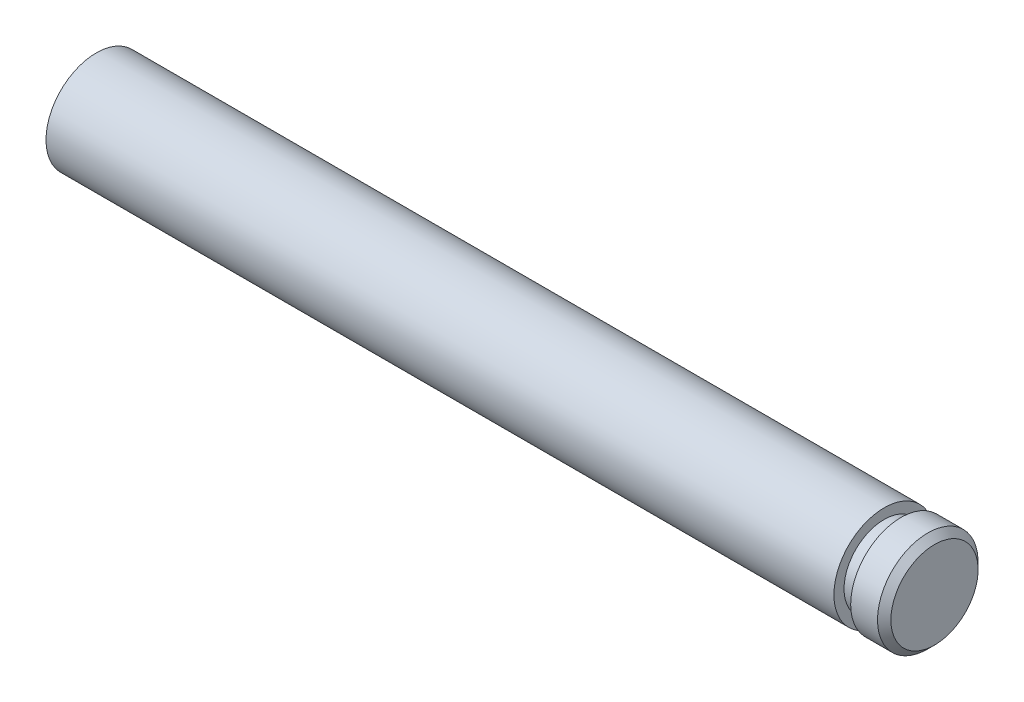
ISO-10303-21;
HEADER;
FILE_DESCRIPTION(('STEP AP214'),'2;1');
FILE_NAME('part.step','',(''),(''),'','','');
FILE_SCHEMA(('AUTOMOTIVE_DESIGN { 1 0 10303 214 1 1 1 1 }'));
ENDSEC;
DATA;
#1=APPLICATION_CONTEXT('core data for automotive mechanical design processes');
#2=APPLICATION_PROTOCOL_DEFINITION('international standard','automotive_design',2000,#1);
#3=PRODUCT_CONTEXT('',#1,'mechanical');
#4=PRODUCT('Part','Part','',(#3));
#5=PRODUCT_RELATED_PRODUCT_CATEGORY('part','',(#4));
#6=PRODUCT_DEFINITION_FORMATION('','',#4);
#7=PRODUCT_DEFINITION_CONTEXT('part definition',#1,'design');
#8=PRODUCT_DEFINITION('design','',#6,#7);
#9=PRODUCT_DEFINITION_SHAPE('','',#8);
#10=(LENGTH_UNIT() NAMED_UNIT(*) SI_UNIT(.MILLI.,.METRE.));
#11=(NAMED_UNIT(*) PLANE_ANGLE_UNIT() SI_UNIT($,.RADIAN.));
#12=(NAMED_UNIT(*) SI_UNIT($,.STERADIAN.) SOLID_ANGLE_UNIT());
#13=UNCERTAINTY_MEASURE_WITH_UNIT(LENGTH_MEASURE(1.E-05),#10,'distance_accuracy_value','');
#14=(GEOMETRIC_REPRESENTATION_CONTEXT(3) GLOBAL_UNCERTAINTY_ASSIGNED_CONTEXT((#13)) GLOBAL_UNIT_ASSIGNED_CONTEXT((#10,
#11,#12)) REPRESENTATION_CONTEXT('',''));
#15=CARTESIAN_POINT('',(0.,0.,0.));
#16=DIRECTION('',(0.,0.,1.));
#17=DIRECTION('',(1.,0.,0.));
#18=AXIS2_PLACEMENT_3D('',#15,#16,#17);
#19=CARTESIAN_POINT('',(0.,0.,-1.5));
#20=DIRECTION('',(1.,0.,0.));
#21=DIRECTION('',(0.,0.,-1.));
#22=AXIS2_PLACEMENT_3D('',#19,#20,#21);
#23=PLANE('',#22);
#24=CARTESIAN_POINT('',(0.,0.,0.));
#25=DIRECTION('',(-1.,0.,0.));
#26=DIRECTION('',(0.,0.,1.));
#27=AXIS2_PLACEMENT_3D('',#24,#25,#26);
#28=CIRCLE('',#27,1.5);
#29=CARTESIAN_POINT('',(0.,0.,1.5));
#30=VERTEX_POINT('',#29);
#31=EDGE_CURVE('E60',#30,#30,#28,.T.);
#32=ORIENTED_EDGE('',*,*,#31,.T.);
#33=EDGE_LOOP('',(#32));
#34=FACE_BOUND('',#33,.T.);
#35=ADVANCED_FACE('F34',(#34),#23,.F.);
#36=CARTESIAN_POINT('',(25.,0.,0.));
#37=DIRECTION('',(-1.,0.,0.));
#38=DIRECTION('',(0.,0.,1.));
#39=AXIS2_PLACEMENT_3D('',#36,#37,#38);
#40=PLANE('',#39);
#41=CARTESIAN_POINT('',(25.,0.,0.));
#42=DIRECTION('',(-1.,0.,0.));
#43=DIRECTION('',(0.,0.,1.));
#44=AXIS2_PLACEMENT_3D('',#41,#42,#43);
#45=CIRCLE('',#44,1.30000000000001);
#46=CARTESIAN_POINT('',(25.,0.,1.30000000000001));
#47=VERTEX_POINT('',#46);
#48=EDGE_CURVE('E10',#47,#47,#45,.F.);
#49=ORIENTED_EDGE('',*,*,#48,.T.);
#50=EDGE_LOOP('',(#49));
#51=FACE_BOUND('',#50,.T.);
#52=ADVANCED_FACE('F91',(#51),#40,.F.);
#53=CARTESIAN_POINT('',(0.,0.,0.));
#54=DIRECTION('',(-1.,0.,0.));
#55=DIRECTION('',(0.,0.,1.));
#56=AXIS2_PLACEMENT_3D('',#53,#54,#55);
#57=CYLINDRICAL_SURFACE('',#56,1.5);
#58=CARTESIAN_POINT('',(24.8,0.,0.));
#59=DIRECTION('',(-1.,0.,0.));
#60=DIRECTION('',(0.,0.,1.));
#61=AXIS2_PLACEMENT_3D('',#58,#59,#60);
#62=CIRCLE('',#61,1.5);
#63=CARTESIAN_POINT('',(24.8,0.,1.5));
#64=VERTEX_POINT('',#63);
#65=EDGE_CURVE('E41',#64,#64,#62,.T.);
#66=ORIENTED_EDGE('',*,*,#65,.T.);
#67=EDGE_LOOP('',(#66));
#68=FACE_BOUND('',#67,.T.);
#69=CARTESIAN_POINT('',(24.,0.,0.));
#70=DIRECTION('',(-1.,0.,0.));
#71=DIRECTION('',(0.,0.,1.));
#72=AXIS2_PLACEMENT_3D('',#69,#70,#71);
#73=CIRCLE('',#72,1.5);
#74=CARTESIAN_POINT('',(24.,0.,1.5));
#75=VERTEX_POINT('',#74);
#76=EDGE_CURVE('E45',#75,#75,#73,.T.);
#77=ORIENTED_EDGE('',*,*,#76,.F.);
#78=EDGE_LOOP('',(#77));
#79=FACE_BOUND('',#78,.T.);
#80=ADVANCED_FACE('F86',(#68,#79),#57,.T.);
#81=CARTESIAN_POINT('',(24.,0.,-1.5));
#82=DIRECTION('',(1.,0.,0.));
#83=DIRECTION('',(0.,0.,-1.));
#84=AXIS2_PLACEMENT_3D('',#81,#82,#83);
#85=PLANE('',#84);
#86=CARTESIAN_POINT('',(24.,0.,0.));
#87=DIRECTION('',(-1.,0.,0.));
#88=DIRECTION('',(0.,0.,1.));
#89=AXIS2_PLACEMENT_3D('',#86,#87,#88);
#90=CIRCLE('',#89,1.19832402234637);
#91=CARTESIAN_POINT('',(24.,0.,1.19832402234637));
#92=VERTEX_POINT('',#91);
#93=EDGE_CURVE('E49',#92,#92,#90,.T.);
#94=ORIENTED_EDGE('',*,*,#93,.F.);
#95=EDGE_LOOP('',(#94));
#96=FACE_BOUND('',#95,.T.);
#97=ORIENTED_EDGE('',*,*,#76,.T.);
#98=EDGE_LOOP('',(#97));
#99=FACE_BOUND('',#98,.T.);
#100=ADVANCED_FACE('F80',(#96,#99),#85,.F.);
#101=CARTESIAN_POINT('',(0.,0.,0.));
#102=DIRECTION('',(-1.,0.,0.));
#103=DIRECTION('',(0.,0.,1.));
#104=AXIS2_PLACEMENT_3D('',#101,#102,#103);
#105=CYLINDRICAL_SURFACE('',#104,1.19832402234637);
#106=CARTESIAN_POINT('',(23.5,0.,0.));
#107=DIRECTION('',(-1.,0.,0.));
#108=DIRECTION('',(0.,0.,1.));
#109=AXIS2_PLACEMENT_3D('',#106,#107,#108);
#110=CIRCLE('',#109,1.19832402234637);
#111=CARTESIAN_POINT('',(23.5,0.,1.19832402234637));
#112=VERTEX_POINT('',#111);
#113=EDGE_CURVE('E54',#112,#112,#110,.T.);
#114=ORIENTED_EDGE('',*,*,#113,.F.);
#115=EDGE_LOOP('',(#114));
#116=FACE_BOUND('',#115,.T.);
#117=ORIENTED_EDGE('',*,*,#93,.T.);
#118=EDGE_LOOP('',(#117));
#119=FACE_BOUND('',#118,.T.);
#120=ADVANCED_FACE('F74',(#116,#119),#105,.T.);
#121=CARTESIAN_POINT('',(23.5,0.,-1.19832402234637));
#122=DIRECTION('',(-1.,0.,0.));
#123=DIRECTION('',(0.,0.,1.));
#124=AXIS2_PLACEMENT_3D('',#121,#122,#123);
#125=PLANE('',#124);
#126=CARTESIAN_POINT('',(23.5,0.,0.));
#127=DIRECTION('',(-1.,0.,0.));
#128=DIRECTION('',(0.,0.,1.));
#129=AXIS2_PLACEMENT_3D('',#126,#127,#128);
#130=CIRCLE('',#129,1.5);
#131=CARTESIAN_POINT('',(23.5,0.,1.5));
#132=VERTEX_POINT('',#131);
#133=EDGE_CURVE('E57',#132,#132,#130,.T.);
#134=ORIENTED_EDGE('',*,*,#133,.F.);
#135=EDGE_LOOP('',(#134));
#136=FACE_BOUND('',#135,.T.);
#137=ORIENTED_EDGE('',*,*,#113,.T.);
#138=EDGE_LOOP('',(#137));
#139=FACE_BOUND('',#138,.T.);
#140=ADVANCED_FACE('F68',(#136,#139),#125,.F.);
#141=CARTESIAN_POINT('',(0.,0.,0.));
#142=DIRECTION('',(-1.,0.,0.));
#143=DIRECTION('',(0.,0.,1.));
#144=AXIS2_PLACEMENT_3D('',#141,#142,#143);
#145=CYLINDRICAL_SURFACE('',#144,1.5);
#146=ORIENTED_EDGE('',*,*,#31,.F.);
#147=EDGE_LOOP('',(#146));
#148=FACE_BOUND('',#147,.T.);
#149=ORIENTED_EDGE('',*,*,#133,.T.);
#150=EDGE_LOOP('',(#149));
#151=FACE_BOUND('',#150,.T.);
#152=ADVANCED_FACE('F65',(#148,#151),#145,.T.);
#153=CARTESIAN_POINT('',(24.8,0.,0.));
#154=DIRECTION('',(-1.,0.,0.));
#155=DIRECTION('',(0.,0.,1.));
#156=AXIS2_PLACEMENT_3D('',#153,#154,#155);
#157=CONICAL_SURFACE('',#156,1.5,0.785398163397448);
#158=ORIENTED_EDGE('',*,*,#48,.F.);
#159=EDGE_LOOP('',(#158));
#160=FACE_BOUND('',#159,.T.);
#161=ORIENTED_EDGE('',*,*,#65,.F.);
#162=EDGE_LOOP('',(#161));
#163=FACE_BOUND('',#162,.T.);
#164=ADVANCED_FACE('F36',(#160,#163),#157,.T.);
#165=CLOSED_SHELL('',(#35,#52,#80,#100,#120,#140,#152,#164));
#166=MANIFOLD_SOLID_BREP('B2',#165);
#167=ADVANCED_BREP_SHAPE_REPRESENTATION('',(#18,#166),#14);
#168=SHAPE_DEFINITION_REPRESENTATION(#9,#167);
ENDSEC;
END-ISO-10303-21;
